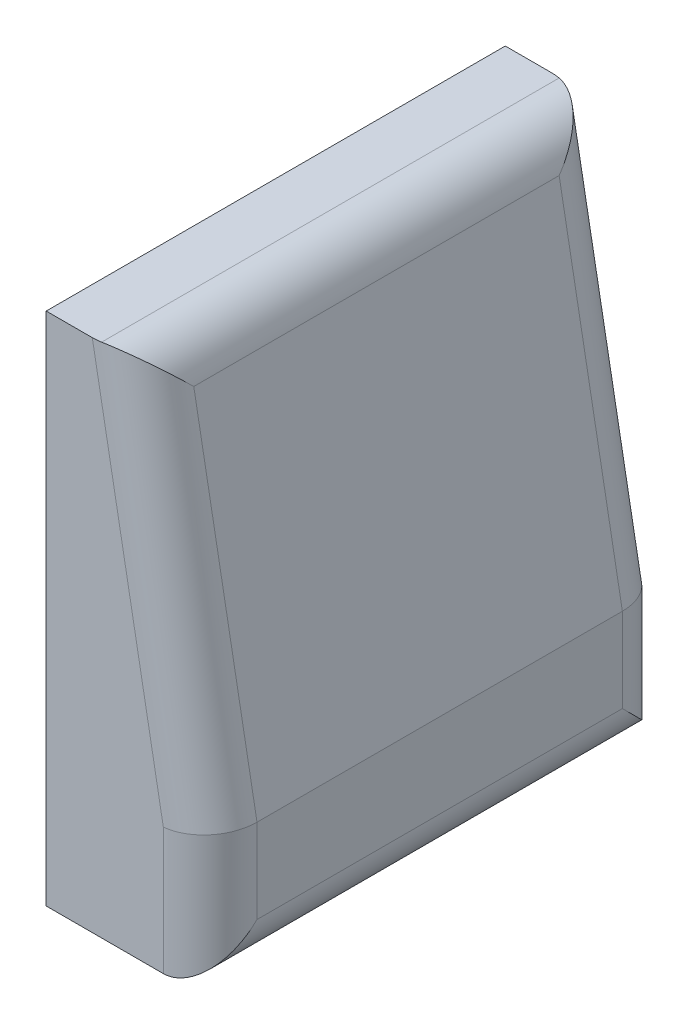
ISO-10303-21;
HEADER;
FILE_DESCRIPTION(('STEP AP214'),'2;1');
FILE_NAME('part.step','',(''),(''),'','','');
FILE_SCHEMA(('AUTOMOTIVE_DESIGN { 1 0 10303 214 1 1 1 1 }'));
ENDSEC;
DATA;
#1=APPLICATION_CONTEXT('core data for automotive mechanical design processes');
#2=APPLICATION_PROTOCOL_DEFINITION('international standard','automotive_design',2000,#1);
#3=PRODUCT_CONTEXT('',#1,'mechanical');
#4=PRODUCT('Part','Part','',(#3));
#5=PRODUCT_RELATED_PRODUCT_CATEGORY('part','',(#4));
#6=PRODUCT_DEFINITION_FORMATION('','',#4);
#7=PRODUCT_DEFINITION_CONTEXT('part definition',#1,'design');
#8=PRODUCT_DEFINITION('design','',#6,#7);
#9=PRODUCT_DEFINITION_SHAPE('','',#8);
#10=(LENGTH_UNIT() NAMED_UNIT(*) SI_UNIT(.MILLI.,.METRE.));
#11=(NAMED_UNIT(*) PLANE_ANGLE_UNIT() SI_UNIT($,.RADIAN.));
#12=(NAMED_UNIT(*) SI_UNIT($,.STERADIAN.) SOLID_ANGLE_UNIT());
#13=UNCERTAINTY_MEASURE_WITH_UNIT(LENGTH_MEASURE(1.E-05),#10,'distance_accuracy_value','');
#14=(GEOMETRIC_REPRESENTATION_CONTEXT(3) GLOBAL_UNCERTAINTY_ASSIGNED_CONTEXT((#13)) GLOBAL_UNIT_ASSIGNED_CONTEXT((#10,
#11,#12)) REPRESENTATION_CONTEXT('',''));
#15=CARTESIAN_POINT('',(0.,0.,0.));
#16=DIRECTION('',(0.,0.,1.));
#17=DIRECTION('',(1.,0.,0.));
#18=AXIS2_PLACEMENT_3D('',#15,#16,#17);
#19=CARTESIAN_POINT('',(200.,550.,490.));
#20=DIRECTION('',(0.,-1.,0.));
#21=DIRECTION('',(0.,0.,-1.));
#22=AXIS2_PLACEMENT_3D('',#19,#20,#21);
#23=PLANE('',#22);
#24=DIRECTION('',(-1.,0.,0.));
#25=VECTOR('',#24,1.);
#26=CARTESIAN_POINT('',(200.,550.,490.));
#27=LINE('',#26,#25);
#28=CARTESIAN_POINT('',(98.3406558713786,550.,490.));
#29=VERTEX_POINT('',#28);
#30=CARTESIAN_POINT('',(1.1199212485011E-13,550.,490.));
#31=VERTEX_POINT('',#30);
#32=EDGE_CURVE('E102',#29,#31,#27,.T.);
#33=ORIENTED_EDGE('',*,*,#32,.F.);
#34=CARTESIAN_POINT('',(98.3406558713786,550.,390.));
#35=DIRECTION('',(0.,-1.,0.));
#36=DIRECTION('',(1.,0.,0.));
#37=AXIS2_PLACEMENT_3D('',#34,#35,#36);
#38=ELLIPSE('',#37,101.659344128622,100.);
#39=CARTESIAN_POINT('',(116.633338798208,550.,488.367740670723));
#40=VERTEX_POINT('',#39);
#41=EDGE_CURVE('E153',#29,#40,#38,.F.);
#42=ORIENTED_EDGE('',*,*,#41,.T.);
#43=DIRECTION('',(0.,0.,-1.));
#44=VECTOR('',#43,1.);
#45=CARTESIAN_POINT('',(116.633338798208,550.,490.));
#46=LINE('',#45,#44);
#47=CARTESIAN_POINT('',(116.633338798208,550.,-488.367740670723));
#48=VERTEX_POINT('',#47);
#49=EDGE_CURVE('E149',#40,#48,#46,.T.);
#50=ORIENTED_EDGE('',*,*,#49,.T.);
#51=CARTESIAN_POINT('',(98.3406558713786,550.,-390.));
#52=DIRECTION('',(0.,-1.,0.));
#53=DIRECTION('',(-1.,0.,0.));
#54=AXIS2_PLACEMENT_3D('',#51,#52,#53);
#55=ELLIPSE('',#54,101.659344128622,100.);
#56=CARTESIAN_POINT('',(98.3406558713786,550.,-490.));
#57=VERTEX_POINT('',#56);
#58=EDGE_CURVE('E151',#48,#57,#55,.F.);
#59=ORIENTED_EDGE('',*,*,#58,.T.);
#60=DIRECTION('',(-1.,0.,0.));
#61=VECTOR('',#60,1.);
#62=CARTESIAN_POINT('',(200.,550.,-490.));
#63=LINE('',#62,#61);
#64=CARTESIAN_POINT('',(1.1199212485011E-13,550.,-490.));
#65=VERTEX_POINT('',#64);
#66=EDGE_CURVE('E125',#57,#65,#63,.T.);
#67=ORIENTED_EDGE('',*,*,#66,.T.);
#68=DIRECTION('',(0.,0.,-1.));
#69=VECTOR('',#68,1.);
#70=CARTESIAN_POINT('',(1.1199212485011E-13,550.,490.));
#71=LINE('',#70,#69);
#72=EDGE_CURVE('E118',#31,#65,#71,.T.);
#73=ORIENTED_EDGE('',*,*,#72,.F.);
#74=EDGE_LOOP('',(#33,#42,#50,#59,#67,#73));
#75=FACE_BOUND('',#74,.T.);
#76=ADVANCED_FACE('F33',(#75),#23,.F.);
#77=CARTESIAN_POINT('',(1.1199212485011E-13,550.,490.));
#78=DIRECTION('',(1.,0.,0.));
#79=DIRECTION('',(0.,1.,0.));
#80=AXIS2_PLACEMENT_3D('',#77,#78,#79);
#81=PLANE('',#80);
#82=DIRECTION('',(0.,-1.,0.));
#83=VECTOR('',#82,1.);
#84=CARTESIAN_POINT('',(1.1199212485011E-13,550.,-490.));
#85=LINE('',#84,#83);
#86=CARTESIAN_POINT('',(0.,-550.,-490.));
#87=VERTEX_POINT('',#86);
#88=EDGE_CURVE('E176',#65,#87,#85,.T.);
#89=ORIENTED_EDGE('',*,*,#88,.T.);
#90=DIRECTION('',(0.,0.,-1.));
#91=VECTOR('',#90,1.);
#92=CARTESIAN_POINT('',(0.,-550.,490.));
#93=LINE('',#92,#91);
#94=CARTESIAN_POINT('',(0.,-550.,490.));
#95=VERTEX_POINT('',#94);
#96=EDGE_CURVE('E120',#95,#87,#93,.T.);
#97=ORIENTED_EDGE('',*,*,#96,.F.);
#98=DIRECTION('',(0.,-1.,0.));
#99=VECTOR('',#98,1.);
#100=CARTESIAN_POINT('',(1.1199212485011E-13,550.,490.));
#101=LINE('',#100,#99);
#102=EDGE_CURVE('E106',#31,#95,#101,.T.);
#103=ORIENTED_EDGE('',*,*,#102,.F.);
#104=ORIENTED_EDGE('',*,*,#72,.T.);
#105=EDGE_LOOP('',(#89,#97,#103,#104));
#106=FACE_BOUND('',#105,.T.);
#107=ADVANCED_FACE('F117',(#106),#81,.F.);
#108=CARTESIAN_POINT('',(0.,-550.,490.));
#109=DIRECTION('',(0.,1.,0.));
#110=DIRECTION('',(0.,0.,1.));
#111=AXIS2_PLACEMENT_3D('',#108,#109,#110);
#112=PLANE('',#111);
#113=DIRECTION('',(1.,0.,0.));
#114=VECTOR('',#113,1.);
#115=CARTESIAN_POINT('',(0.,-550.,-490.));
#116=LINE('',#115,#114);
#117=CARTESIAN_POINT('',(250.,-550.,-490.));
#118=VERTEX_POINT('',#117);
#119=EDGE_CURVE('E113',#87,#118,#116,.T.);
#120=ORIENTED_EDGE('',*,*,#119,.T.);
#121=DIRECTION('',(0.,0.,-1.));
#122=VECTOR('',#121,1.);
#123=CARTESIAN_POINT('',(250.,-550.,490.));
#124=LINE('',#123,#122);
#125=CARTESIAN_POINT('',(250.,-550.,490.));
#126=VERTEX_POINT('',#125);
#127=EDGE_CURVE('E144',#118,#126,#124,.F.);
#128=ORIENTED_EDGE('',*,*,#127,.T.);
#129=DIRECTION('',(1.,0.,0.));
#130=VECTOR('',#129,1.);
#131=CARTESIAN_POINT('',(0.,-550.,490.));
#132=LINE('',#131,#130);
#133=EDGE_CURVE('E122',#95,#126,#132,.T.);
#134=ORIENTED_EDGE('',*,*,#133,.F.);
#135=ORIENTED_EDGE('',*,*,#96,.T.);
#136=EDGE_LOOP('',(#120,#128,#134,#135));
#137=FACE_BOUND('',#136,.T.);
#138=ADVANCED_FACE('F219',(#137),#112,.F.);
#139=CARTESIAN_POINT('',(350.,-550.,490.));
#140=DIRECTION('',(-1.,0.,0.));
#141=DIRECTION('',(0.,0.,1.));
#142=AXIS2_PLACEMENT_3D('',#139,#140,#141);
#143=PLANE('',#142);
#144=DIRECTION('',(0.,0.,-1.));
#145=VECTOR('',#144,1.);
#146=CARTESIAN_POINT('',(350.,-450.,490.));
#147=LINE('',#146,#145);
#148=CARTESIAN_POINT('',(350.,-450.,390.));
#149=VERTEX_POINT('',#148);
#150=CARTESIAN_POINT('',(350.,-450.,-390.));
#151=VERTEX_POINT('',#150);
#152=EDGE_CURVE('E129',#149,#151,#147,.T.);
#153=ORIENTED_EDGE('',*,*,#152,.T.);
#154=DIRECTION('',(0.,1.,0.));
#155=VECTOR('',#154,1.);
#156=CARTESIAN_POINT('',(350.,-550.,-390.));
#157=LINE('',#156,#155);
#158=CARTESIAN_POINT('',(350.,-270.,-390.));
#159=VERTEX_POINT('',#158);
#160=EDGE_CURVE('E136',#151,#159,#157,.T.);
#161=ORIENTED_EDGE('',*,*,#160,.T.);
#162=DIRECTION('',(0.,0.,-1.));
#163=VECTOR('',#162,1.);
#164=CARTESIAN_POINT('',(350.,-270.,490.));
#165=LINE('',#164,#163);
#166=CARTESIAN_POINT('',(350.,-270.,390.));
#167=VERTEX_POINT('',#166);
#168=EDGE_CURVE('E131',#167,#159,#165,.T.);
#169=ORIENTED_EDGE('',*,*,#168,.F.);
#170=DIRECTION('',(0.,1.,0.));
#171=VECTOR('',#170,1.);
#172=CARTESIAN_POINT('',(350.,-550.,390.));
#173=LINE('',#172,#171);
#174=EDGE_CURVE('E127',#167,#149,#173,.F.);
#175=ORIENTED_EDGE('',*,*,#174,.T.);
#176=EDGE_LOOP('',(#153,#161,#169,#175));
#177=FACE_BOUND('',#176,.T.);
#178=ADVANCED_FACE('F193',(#177),#143,.F.);
#179=CARTESIAN_POINT('',(350.,-270.,490.));
#180=DIRECTION('',(-0.983677406707226,-0.17994098903181,0.));
#181=DIRECTION('',(0.17994098903181,-0.983677406707226,0.));
#182=AXIS2_PLACEMENT_3D('',#179,#180,#181);
#183=PLANE('',#182);
#184=DIRECTION('',(0.,0.,-1.));
#185=VECTOR('',#184,1.);
#186=CARTESIAN_POINT('',(215.00107946893,467.994098903181,490.));
#187=LINE('',#186,#185);
#188=CARTESIAN_POINT('',(215.00107946893,467.994098903181,-390.));
#189=VERTEX_POINT('',#188);
#190=CARTESIAN_POINT('',(215.00107946893,467.994098903181,390.));
#191=VERTEX_POINT('',#190);
#192=EDGE_CURVE('E49',#189,#191,#187,.F.);
#193=ORIENTED_EDGE('',*,*,#192,.T.);
#194=DIRECTION('',(-0.17994098903181,0.983677406707226,0.));
#195=VECTOR('',#194,1.);
#196=CARTESIAN_POINT('',(350.,-270.,390.));
#197=LINE('',#196,#195);
#198=EDGE_CURVE('E11',#191,#167,#197,.F.);
#199=ORIENTED_EDGE('',*,*,#198,.T.);
#200=ORIENTED_EDGE('',*,*,#168,.T.);
#201=DIRECTION('',(-0.17994098903181,0.983677406707226,0.));
#202=VECTOR('',#201,1.);
#203=CARTESIAN_POINT('',(350.,-270.,-390.));
#204=LINE('',#203,#202);
#205=EDGE_CURVE('E42',#159,#189,#204,.T.);
#206=ORIENTED_EDGE('',*,*,#205,.T.);
#207=EDGE_LOOP('',(#193,#199,#200,#206));
#208=FACE_BOUND('',#207,.T.);
#209=ADVANCED_FACE('F226',(#208),#183,.F.);
#210=CARTESIAN_POINT('',(0.,0.,490.));
#211=DIRECTION('',(0.,0.,1.));
#212=DIRECTION('',(1.,0.,0.));
#213=AXIS2_PLACEMENT_3D('',#210,#211,#212);
#214=PLANE('',#213);
#215=ORIENTED_EDGE('',*,*,#133,.T.);
#216=DIRECTION('',(0.,1.,0.));
#217=VECTOR('',#216,1.);
#218=CARTESIAN_POINT('',(250.,-270.,490.));
#219=LINE('',#218,#217);
#220=CARTESIAN_POINT('',(250.,-279.071081236465,490.));
#221=VERTEX_POINT('',#220);
#222=EDGE_CURVE('E147',#126,#221,#219,.T.);
#223=ORIENTED_EDGE('',*,*,#222,.T.);
#224=DIRECTION('',(-0.17994098903181,0.983677406707226,0.));
#225=VECTOR('',#224,1.);
#226=CARTESIAN_POINT('',(101.632259329278,532.005901096819,490.));
#227=LINE('',#226,#225);
#228=EDGE_CURVE('E109',#221,#29,#227,.T.);
#229=ORIENTED_EDGE('',*,*,#228,.T.);
#230=ORIENTED_EDGE('',*,*,#32,.T.);
#231=ORIENTED_EDGE('',*,*,#102,.T.);
#232=EDGE_LOOP('',(#215,#223,#229,#230,#231));
#233=FACE_BOUND('',#232,.T.);
#234=ADVANCED_FACE('F105',(#233),#214,.T.);
#235=CARTESIAN_POINT('',(0.,0.,-490.));
#236=DIRECTION('',(0.,0.,1.));
#237=DIRECTION('',(1.,0.,0.));
#238=AXIS2_PLACEMENT_3D('',#235,#236,#237);
#239=PLANE('',#238);
#240=DIRECTION('',(-0.17994098903181,0.983677406707226,0.));
#241=VECTOR('',#240,1.);
#242=CARTESIAN_POINT('',(192.508644420658,35.2149959306081,-490.));
#243=LINE('',#242,#241);
#244=CARTESIAN_POINT('',(250.,-279.071081236465,-490.));
#245=VERTEX_POINT('',#244);
#246=EDGE_CURVE('E139',#57,#245,#243,.F.);
#247=ORIENTED_EDGE('',*,*,#246,.T.);
#248=DIRECTION('',(0.,1.,0.));
#249=VECTOR('',#248,1.);
#250=CARTESIAN_POINT('',(250.,0.,-490.));
#251=LINE('',#250,#249);
#252=EDGE_CURVE('E141',#245,#118,#251,.F.);
#253=ORIENTED_EDGE('',*,*,#252,.T.);
#254=ORIENTED_EDGE('',*,*,#119,.F.);
#255=ORIENTED_EDGE('',*,*,#88,.F.);
#256=ORIENTED_EDGE('',*,*,#66,.F.);
#257=EDGE_LOOP('',(#247,#253,#254,#255,#256));
#258=FACE_BOUND('',#257,.T.);
#259=ADVANCED_FACE('F204',(#258),#239,.F.);
#260=CARTESIAN_POINT('',(192.508644420658,35.2149959306081,390.));
#261=DIRECTION('',(0.17994098903181,-0.983677406707226,0.));
#262=DIRECTION('',(0.983677406707226,0.17994098903181,0.));
#263=AXIS2_PLACEMENT_3D('',#260,#261,#262);
#264=CYLINDRICAL_SURFACE('',#263,100.);
#265=ORIENTED_EDGE('',*,*,#41,.F.);
#266=ORIENTED_EDGE('',*,*,#228,.F.);
#267=CARTESIAN_POINT('',(250.,-279.071081236465,390.));
#268=DIRECTION('',(0.0903398950983827,-0.995910991682296,0.));
#269=DIRECTION('',(0.995910991682295,0.0903398950983824,0.));
#270=AXIS2_PLACEMENT_3D('',#267,#268,#269);
#271=ELLIPSE('',#270,100.410579695561,100.);
#272=EDGE_CURVE('E37',#167,#221,#271,.T.);
#273=ORIENTED_EDGE('',*,*,#272,.F.);
#274=ORIENTED_EDGE('',*,*,#198,.F.);
#275=CARTESIAN_POINT('',(116.633338798208,450.,390.));
#276=DIRECTION('',(-0.127237493557807,0.695564964782677,-0.707106781186547));
#277=DIRECTION('',(0.127237493557807,-0.695564964782677,-0.707106781186547));
#278=AXIS2_PLACEMENT_3D('',#275,#276,#277);
#279=ELLIPSE('',#278,141.421356237309,100.);
#280=EDGE_CURVE('E166',#40,#191,#279,.T.);
#281=ORIENTED_EDGE('',*,*,#280,.F.);
#282=EDGE_LOOP('',(#265,#266,#273,#274,#281));
#283=FACE_BOUND('',#282,.T.);
#284=ADVANCED_FACE('F35',(#283),#264,.T.);
#285=CARTESIAN_POINT('',(250.,0.,390.));
#286=DIRECTION('',(0.,-1.,0.));
#287=DIRECTION('',(0.,0.,-1.));
#288=AXIS2_PLACEMENT_3D('',#285,#286,#287);
#289=CYLINDRICAL_SURFACE('',#288,100.);
#290=ORIENTED_EDGE('',*,*,#272,.T.);
#291=ORIENTED_EDGE('',*,*,#222,.F.);
#292=CARTESIAN_POINT('',(250.,-450.,390.));
#293=DIRECTION('',(0.,-0.707106781186547,-0.707106781186547));
#294=DIRECTION('',(0.,-0.707106781186547,0.707106781186547));
#295=AXIS2_PLACEMENT_3D('',#292,#293,#294);
#296=ELLIPSE('',#295,141.421356237309,100.);
#297=EDGE_CURVE('E164',#149,#126,#296,.T.);
#298=ORIENTED_EDGE('',*,*,#297,.F.);
#299=ORIENTED_EDGE('',*,*,#174,.F.);
#300=EDGE_LOOP('',(#290,#291,#298,#299));
#301=FACE_BOUND('',#300,.T.);
#302=ADVANCED_FACE('F185',(#301),#289,.T.);
#303=CARTESIAN_POINT('',(116.633338798208,450.,490.));
#304=DIRECTION('',(0.,0.,-1.));
#305=DIRECTION('',(-1.,0.,0.));
#306=AXIS2_PLACEMENT_3D('',#303,#304,#305);
#307=CYLINDRICAL_SURFACE('',#306,100.);
#308=ORIENTED_EDGE('',*,*,#280,.T.);
#309=ORIENTED_EDGE('',*,*,#192,.F.);
#310=CARTESIAN_POINT('',(116.633338798208,450.,-390.));
#311=DIRECTION('',(0.127237493557807,-0.695564964782677,-0.707106781186547));
#312=DIRECTION('',(-0.127237493557807,0.695564964782677,-0.707106781186547));
#313=AXIS2_PLACEMENT_3D('',#310,#311,#312);
#314=ELLIPSE('',#313,141.421356237309,100.);
#315=EDGE_CURVE('E161',#48,#189,#314,.T.);
#316=ORIENTED_EDGE('',*,*,#315,.F.);
#317=ORIENTED_EDGE('',*,*,#49,.F.);
#318=EDGE_LOOP('',(#308,#309,#316,#317));
#319=FACE_BOUND('',#318,.T.);
#320=ADVANCED_FACE('F197',(#319),#307,.T.);
#321=CARTESIAN_POINT('',(250.,-450.,490.));
#322=DIRECTION('',(0.,0.,-1.));
#323=DIRECTION('',(-1.,0.,0.));
#324=AXIS2_PLACEMENT_3D('',#321,#322,#323);
#325=CYLINDRICAL_SURFACE('',#324,100.);
#326=ORIENTED_EDGE('',*,*,#297,.T.);
#327=ORIENTED_EDGE('',*,*,#127,.F.);
#328=CARTESIAN_POINT('',(250.,-450.,-390.));
#329=DIRECTION('',(0.,0.707106781186547,-0.707106781186547));
#330=DIRECTION('',(0.,-0.707106781186547,-0.707106781186547));
#331=AXIS2_PLACEMENT_3D('',#328,#329,#330);
#332=ELLIPSE('',#331,141.421356237309,100.);
#333=EDGE_CURVE('E159',#151,#118,#332,.T.);
#334=ORIENTED_EDGE('',*,*,#333,.F.);
#335=ORIENTED_EDGE('',*,*,#152,.F.);
#336=EDGE_LOOP('',(#326,#327,#334,#335));
#337=FACE_BOUND('',#336,.T.);
#338=ADVANCED_FACE('F189',(#337),#325,.T.);
#339=CARTESIAN_POINT('',(251.632259329277,-287.994098903181,-390.));
#340=DIRECTION('',(-0.17994098903181,0.983677406707226,0.));
#341=DIRECTION('',(-0.983677406707226,-0.17994098903181,0.));
#342=AXIS2_PLACEMENT_3D('',#339,#340,#341);
#343=CYLINDRICAL_SURFACE('',#342,100.);
#344=ORIENTED_EDGE('',*,*,#315,.T.);
#345=ORIENTED_EDGE('',*,*,#205,.F.);
#346=CARTESIAN_POINT('',(250.,-279.071081236464,-390.));
#347=DIRECTION('',(-0.0903398950983827,0.995910991682296,0.));
#348=DIRECTION('',(-0.995910991682295,-0.0903398950983824,0.));
#349=AXIS2_PLACEMENT_3D('',#346,#347,#348);
#350=ELLIPSE('',#349,100.410579695561,100.);
#351=EDGE_CURVE('E157',#245,#159,#350,.F.);
#352=ORIENTED_EDGE('',*,*,#351,.F.);
#353=ORIENTED_EDGE('',*,*,#246,.F.);
#354=ORIENTED_EDGE('',*,*,#58,.F.);
#355=EDGE_LOOP('',(#344,#345,#352,#353,#354));
#356=FACE_BOUND('',#355,.T.);
#357=ADVANCED_FACE('F200',(#356),#343,.T.);
#358=CARTESIAN_POINT('',(250.,-550.,-390.));
#359=DIRECTION('',(0.,1.,0.));
#360=DIRECTION('',(0.,0.,1.));
#361=AXIS2_PLACEMENT_3D('',#358,#359,#360);
#362=CYLINDRICAL_SURFACE('',#361,100.);
#363=ORIENTED_EDGE('',*,*,#333,.T.);
#364=ORIENTED_EDGE('',*,*,#252,.F.);
#365=ORIENTED_EDGE('',*,*,#351,.T.);
#366=ORIENTED_EDGE('',*,*,#160,.F.);
#367=EDGE_LOOP('',(#363,#364,#365,#366));
#368=FACE_BOUND('',#367,.T.);
#369=ADVANCED_FACE('F207',(#368),#362,.T.);
#370=CLOSED_SHELL('',(#76,#107,#138,#178,#209,#234,#259,#284,#302,#320,#338,#357,#369));
#371=MANIFOLD_SOLID_BREP('B2',#370);
#372=ADVANCED_BREP_SHAPE_REPRESENTATION('',(#18,#371),#14);
#373=SHAPE_DEFINITION_REPRESENTATION(#9,#372);
ENDSEC;
END-ISO-10303-21;
